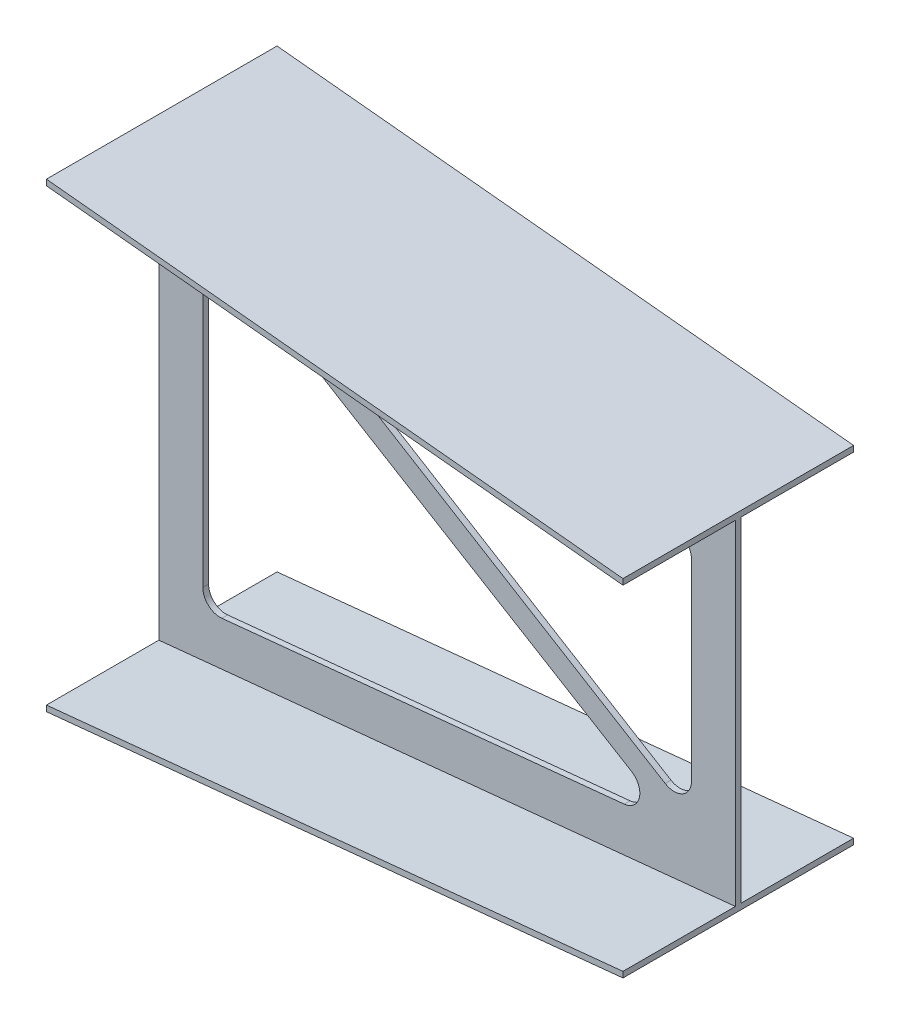
ISO-10303-21;
HEADER;
FILE_DESCRIPTION(('STEP AP214'),'2;1');
FILE_NAME('part.step','',(''),(''),'','','');
FILE_SCHEMA(('AUTOMOTIVE_DESIGN { 1 0 10303 214 1 1 1 1 }'));
ENDSEC;
DATA;
#1=APPLICATION_CONTEXT('core data for automotive mechanical design processes');
#2=APPLICATION_PROTOCOL_DEFINITION('international standard','automotive_design',2000,#1);
#3=PRODUCT_CONTEXT('',#1,'mechanical');
#4=PRODUCT('Part','Part','',(#3));
#5=PRODUCT_RELATED_PRODUCT_CATEGORY('part','',(#4));
#6=PRODUCT_DEFINITION_FORMATION('','',#4);
#7=PRODUCT_DEFINITION_CONTEXT('part definition',#1,'design');
#8=PRODUCT_DEFINITION('design','',#6,#7);
#9=PRODUCT_DEFINITION_SHAPE('','',#8);
#10=(LENGTH_UNIT() NAMED_UNIT(*) SI_UNIT(.MILLI.,.METRE.));
#11=(NAMED_UNIT(*) PLANE_ANGLE_UNIT() SI_UNIT($,.RADIAN.));
#12=(NAMED_UNIT(*) SI_UNIT($,.STERADIAN.) SOLID_ANGLE_UNIT());
#13=UNCERTAINTY_MEASURE_WITH_UNIT(LENGTH_MEASURE(1.E-05),#10,'distance_accuracy_value','');
#14=(GEOMETRIC_REPRESENTATION_CONTEXT(3) GLOBAL_UNCERTAINTY_ASSIGNED_CONTEXT((#13)) GLOBAL_UNIT_ASSIGNED_CONTEXT((#10,
#11,#12)) REPRESENTATION_CONTEXT('',''));
#15=CARTESIAN_POINT('',(0.,0.,0.));
#16=DIRECTION('',(0.,0.,1.));
#17=DIRECTION('',(1.,0.,0.));
#18=AXIS2_PLACEMENT_3D('',#15,#16,#17);
#19=CARTESIAN_POINT('',(1000.,0.,0.));
#20=DIRECTION('',(-1.,0.,0.));
#21=DIRECTION('',(0.,0.,1.));
#22=AXIS2_PLACEMENT_3D('',#19,#20,#21);
#23=PLANE('',#22);
#24=DIRECTION('',(0.,-1.,0.));
#25=VECTOR('',#24,1.);
#26=CARTESIAN_POINT('',(1000.,300.,-195.));
#27=LINE('',#26,#25);
#28=CARTESIAN_POINT('',(1000.,300.,-195.));
#29=VERTEX_POINT('',#28);
#30=CARTESIAN_POINT('',(1000.,290.,-195.));
#31=VERTEX_POINT('',#30);
#32=EDGE_CURVE('E589',#29,#31,#27,.T.);
#33=ORIENTED_EDGE('',*,*,#32,.F.);
#34=DIRECTION('',(0.,0.,-1.));
#35=VECTOR('',#34,1.);
#36=CARTESIAN_POINT('',(1000.,300.,-195.));
#37=LINE('',#36,#35);
#38=CARTESIAN_POINT('',(1000.,300.,205.));
#39=VERTEX_POINT('',#38);
#40=EDGE_CURVE('E718',#39,#29,#37,.T.);
#41=ORIENTED_EDGE('',*,*,#40,.F.);
#42=DIRECTION('',(0.,1.,0.));
#43=VECTOR('',#42,1.);
#44=CARTESIAN_POINT('',(1000.,300.,205.));
#45=LINE('',#44,#43);
#46=CARTESIAN_POINT('',(1000.,290.,205.));
#47=VERTEX_POINT('',#46);
#48=EDGE_CURVE('E338',#47,#39,#45,.T.);
#49=ORIENTED_EDGE('',*,*,#48,.F.);
#50=DIRECTION('',(0.,0.,1.));
#51=VECTOR('',#50,1.);
#52=CARTESIAN_POINT('',(1000.,290.,10.0000000000002));
#53=LINE('',#52,#51);
#54=CARTESIAN_POINT('',(1000.,290.,10.0000000000002));
#55=VERTEX_POINT('',#54);
#56=EDGE_CURVE('E352',#55,#47,#53,.T.);
#57=ORIENTED_EDGE('',*,*,#56,.F.);
#58=DIRECTION('',(0.,1.,0.));
#59=VECTOR('',#58,1.);
#60=CARTESIAN_POINT('',(1000.,290.,10.0000000000002));
#61=LINE('',#60,#59);
#62=CARTESIAN_POINT('',(1000.,-290.,10.0000000000002));
#63=VERTEX_POINT('',#62);
#64=EDGE_CURVE('E844',#63,#55,#61,.T.);
#65=ORIENTED_EDGE('',*,*,#64,.F.);
#66=DIRECTION('',(0.,0.,-1.));
#67=VECTOR('',#66,1.);
#68=CARTESIAN_POINT('',(1000.,-290.,10.0000000000002));
#69=LINE('',#68,#67);
#70=CARTESIAN_POINT('',(1000.,-290.,205.));
#71=VERTEX_POINT('',#70);
#72=EDGE_CURVE('E846',#71,#63,#69,.T.);
#73=ORIENTED_EDGE('',*,*,#72,.F.);
#74=DIRECTION('',(0.,1.,0.));
#75=VECTOR('',#74,1.);
#76=CARTESIAN_POINT('',(1000.,-290.,205.));
#77=LINE('',#76,#75);
#78=CARTESIAN_POINT('',(1000.,-300.,205.));
#79=VERTEX_POINT('',#78);
#80=EDGE_CURVE('E849',#79,#71,#77,.T.);
#81=ORIENTED_EDGE('',*,*,#80,.F.);
#82=DIRECTION('',(0.,0.,1.));
#83=VECTOR('',#82,1.);
#84=CARTESIAN_POINT('',(1000.,-300.,-195.));
#85=LINE('',#84,#83);
#86=CARTESIAN_POINT('',(1000.,-300.,-195.));
#87=VERTEX_POINT('',#86);
#88=EDGE_CURVE('E468',#87,#79,#85,.T.);
#89=ORIENTED_EDGE('',*,*,#88,.F.);
#90=DIRECTION('',(0.,-1.,0.));
#91=VECTOR('',#90,1.);
#92=CARTESIAN_POINT('',(1000.,-290.,-195.));
#93=LINE('',#92,#91);
#94=CARTESIAN_POINT('',(1000.,-290.,-195.));
#95=VERTEX_POINT('',#94);
#96=EDGE_CURVE('E482',#95,#87,#93,.T.);
#97=ORIENTED_EDGE('',*,*,#96,.F.);
#98=DIRECTION('',(0.,0.,-1.));
#99=VECTOR('',#98,1.);
#100=CARTESIAN_POINT('',(1000.,-290.,-195.));
#101=LINE('',#100,#99);
#102=CARTESIAN_POINT('',(1000.,-290.,4.44089209850063E-13));
#103=VERTEX_POINT('',#102);
#104=EDGE_CURVE('E964',#103,#95,#101,.T.);
#105=ORIENTED_EDGE('',*,*,#104,.F.);
#106=DIRECTION('',(0.,-1.,0.));
#107=VECTOR('',#106,1.);
#108=CARTESIAN_POINT('',(1000.,290.,4.44089209850063E-13));
#109=LINE('',#108,#107);
#110=CARTESIAN_POINT('',(1000.,290.,4.44089209850063E-13));
#111=VERTEX_POINT('',#110);
#112=EDGE_CURVE('E733',#111,#103,#109,.T.);
#113=ORIENTED_EDGE('',*,*,#112,.F.);
#114=DIRECTION('',(0.,0.,1.));
#115=VECTOR('',#114,1.);
#116=CARTESIAN_POINT('',(1000.,290.,-195.));
#117=LINE('',#116,#115);
#118=EDGE_CURVE('E575',#31,#111,#117,.T.);
#119=ORIENTED_EDGE('',*,*,#118,.F.);
#120=EDGE_LOOP('',(#33,#41,#49,#57,#65,#73,#81,#89,#97,#105,#113,#119));
#121=FACE_BOUND('',#120,.T.);
#122=ADVANCED_FACE('F61',(#121),#23,.F.);
#123=CARTESIAN_POINT('',(0.,0.,0.));
#124=DIRECTION('',(1.,0.,0.));
#125=DIRECTION('',(0.,0.,-1.));
#126=AXIS2_PLACEMENT_3D('',#123,#124,#125);
#127=PLANE('',#126);
#128=DIRECTION('',(0.,-1.,0.));
#129=VECTOR('',#128,1.);
#130=CARTESIAN_POINT('',(0.,400.,205.));
#131=LINE('',#130,#129);
#132=CARTESIAN_POINT('',(0.,400.,205.));
#133=VERTEX_POINT('',#132);
#134=CARTESIAN_POINT('',(0.,390.,205.));
#135=VERTEX_POINT('',#134);
#136=EDGE_CURVE('E284',#133,#135,#131,.T.);
#137=ORIENTED_EDGE('',*,*,#136,.F.);
#138=DIRECTION('',(0.,0.,1.));
#139=VECTOR('',#138,1.);
#140=CARTESIAN_POINT('',(0.,400.,205.));
#141=LINE('',#140,#139);
#142=CARTESIAN_POINT('',(0.,400.,-195.));
#143=VERTEX_POINT('',#142);
#144=EDGE_CURVE('E299',#143,#133,#141,.T.);
#145=ORIENTED_EDGE('',*,*,#144,.F.);
#146=DIRECTION('',(0.,1.,0.));
#147=VECTOR('',#146,1.);
#148=CARTESIAN_POINT('',(0.,400.,-195.));
#149=LINE('',#148,#147);
#150=CARTESIAN_POINT('',(0.,390.,-195.));
#151=VERTEX_POINT('',#150);
#152=EDGE_CURVE('E604',#151,#143,#149,.T.);
#153=ORIENTED_EDGE('',*,*,#152,.F.);
#154=DIRECTION('',(0.,0.,-1.));
#155=VECTOR('',#154,1.);
#156=CARTESIAN_POINT('',(0.,390.,-1.97758476261356E-13));
#157=LINE('',#156,#155);
#158=CARTESIAN_POINT('',(0.,390.,-1.97758476261356E-13));
#159=VERTEX_POINT('',#158);
#160=EDGE_CURVE('E711',#159,#151,#157,.T.);
#161=ORIENTED_EDGE('',*,*,#160,.F.);
#162=DIRECTION('',(0.,1.,0.));
#163=VECTOR('',#162,1.);
#164=CARTESIAN_POINT('',(0.,390.,-1.97758476261356E-13));
#165=LINE('',#164,#163);
#166=CARTESIAN_POINT('',(0.,-390.,-1.97758476261356E-13));
#167=VERTEX_POINT('',#166);
#168=EDGE_CURVE('E542',#167,#159,#165,.T.);
#169=ORIENTED_EDGE('',*,*,#168,.F.);
#170=DIRECTION('',(0.,0.,1.));
#171=VECTOR('',#170,1.);
#172=CARTESIAN_POINT('',(0.,-390.,-1.97758476261356E-13));
#173=LINE('',#172,#171);
#174=CARTESIAN_POINT('',(0.,-390.,-195.));
#175=VERTEX_POINT('',#174);
#176=EDGE_CURVE('E524',#175,#167,#173,.T.);
#177=ORIENTED_EDGE('',*,*,#176,.F.);
#178=DIRECTION('',(0.,1.,0.));
#179=VECTOR('',#178,1.);
#180=CARTESIAN_POINT('',(0.,-390.,-195.));
#181=LINE('',#180,#179);
#182=CARTESIAN_POINT('',(0.,-400.,-195.));
#183=VERTEX_POINT('',#182);
#184=EDGE_CURVE('E704',#183,#175,#181,.T.);
#185=ORIENTED_EDGE('',*,*,#184,.F.);
#186=DIRECTION('',(0.,0.,-1.));
#187=VECTOR('',#186,1.);
#188=CARTESIAN_POINT('',(0.,-400.,205.));
#189=LINE('',#188,#187);
#190=CARTESIAN_POINT('',(0.,-400.,205.));
#191=VERTEX_POINT('',#190);
#192=EDGE_CURVE('E700',#191,#183,#189,.T.);
#193=ORIENTED_EDGE('',*,*,#192,.F.);
#194=DIRECTION('',(0.,-1.,0.));
#195=VECTOR('',#194,1.);
#196=CARTESIAN_POINT('',(0.,-390.,205.));
#197=LINE('',#196,#195);
#198=CARTESIAN_POINT('',(0.,-390.,205.));
#199=VERTEX_POINT('',#198);
#200=EDGE_CURVE('E433',#199,#191,#197,.T.);
#201=ORIENTED_EDGE('',*,*,#200,.F.);
#202=DIRECTION('',(0.,0.,1.));
#203=VECTOR('',#202,1.);
#204=CARTESIAN_POINT('',(0.,-390.,205.));
#205=LINE('',#204,#203);
#206=CARTESIAN_POINT('',(0.,-390.,10.0000000000002));
#207=VERTEX_POINT('',#206);
#208=EDGE_CURVE('E415',#207,#199,#205,.T.);
#209=ORIENTED_EDGE('',*,*,#208,.F.);
#210=DIRECTION('',(0.,-1.,0.));
#211=VECTOR('',#210,1.);
#212=CARTESIAN_POINT('',(0.,390.,10.0000000000002));
#213=LINE('',#212,#211);
#214=CARTESIAN_POINT('',(0.,390.,10.0000000000002));
#215=VERTEX_POINT('',#214);
#216=EDGE_CURVE('E398',#215,#207,#213,.T.);
#217=ORIENTED_EDGE('',*,*,#216,.F.);
#218=DIRECTION('',(0.,0.,-1.));
#219=VECTOR('',#218,1.);
#220=CARTESIAN_POINT('',(0.,390.,205.));
#221=LINE('',#220,#219);
#222=EDGE_CURVE('E688',#135,#215,#221,.T.);
#223=ORIENTED_EDGE('',*,*,#222,.F.);
#224=EDGE_LOOP('',(#137,#145,#153,#161,#169,#177,#185,#193,#201,#209,#217,#223));
#225=FACE_BOUND('',#224,.T.);
#226=ADVANCED_FACE('F616',(#225),#127,.F.);
#227=CARTESIAN_POINT('',(0.,0.,10.0000000000002));
#228=DIRECTION('',(0.,0.,1.));
#229=DIRECTION('',(1.,0.,0.));
#230=AXIS2_PLACEMENT_3D('',#227,#228,#229);
#231=PLANE('',#230);
#232=CARTESIAN_POINT('',(804.27647772001,-202.842673131695,10.0000000000002));
#233=DIRECTION('',(0.,0.,1.));
#234=DIRECTION('',(1.,0.,0.));
#235=AXIS2_PLACEMENT_3D('',#232,#233,#234);
#236=CIRCLE('',#235,30.);
#237=CARTESIAN_POINT('',(807.261589290639,-232.693788837995,10.0000000000002));
#238=VERTEX_POINT('',#237);
#239=CARTESIAN_POINT('',(819.804188987503,-177.17381685033,10.0000000000002));
#240=VERTEX_POINT('',#239);
#241=EDGE_CURVE('E76',#238,#240,#236,.T.);
#242=ORIENTED_EDGE('',*,*,#241,.F.);
#243=DIRECTION('',(0.995037190209989,0.0995037190209989,0.));
#244=VECTOR('',#243,1.);
#245=CARTESIAN_POINT('',(109.18511157063,-302.501436609996,10.0000000000002));
#246=LINE('',#245,#244);
#247=CARTESIAN_POINT('',(109.18511157063,-302.501436609996,10.0000000000002));
#248=VERTEX_POINT('',#247);
#249=EDGE_CURVE('E254',#248,#238,#246,.T.);
#250=ORIENTED_EDGE('',*,*,#249,.F.);
#251=CARTESIAN_POINT('',(106.2,-272.650320903696,10.0000000000002));
#252=DIRECTION('',(0.,0.,1.));
#253=DIRECTION('',(-1.,0.,0.));
#254=AXIS2_PLACEMENT_3D('',#251,#252,#253);
#255=CIRCLE('',#254,30.);
#256=CARTESIAN_POINT('',(76.2,-272.650320903696,10.0000000000002));
#257=VERTEX_POINT('',#256);
#258=EDGE_CURVE('E248',#257,#248,#255,.T.);
#259=ORIENTED_EDGE('',*,*,#258,.F.);
#260=DIRECTION('',(0.,-1.,0.));
#261=VECTOR('',#260,1.);
#262=CARTESIAN_POINT('',(76.2,219.440652227635,10.0000000000002));
#263=LINE('',#262,#261);
#264=CARTESIAN_POINT('',(76.2,219.440652227635,10.0000000000002));
#265=VERTEX_POINT('',#264);
#266=EDGE_CURVE('E246',#265,#257,#263,.T.);
#267=ORIENTED_EDGE('',*,*,#266,.F.);
#268=CARTESIAN_POINT('',(106.2,219.440652227636,10.0000000000002));
#269=DIRECTION('',(0.,0.,1.));
#270=DIRECTION('',(-1.,0.,0.));
#271=AXIS2_PLACEMENT_3D('',#268,#269,#270);
#272=CIRCLE('',#271,30.);
#273=CARTESIAN_POINT('',(121.727711267494,245.109508509,10.0000000000002));
#274=VERTEX_POINT('',#273);
#275=EDGE_CURVE('E228',#274,#265,#272,.T.);
#276=ORIENTED_EDGE('',*,*,#275,.F.);
#277=DIRECTION('',(-0.855628542712151,0.517590375583126,0.));
#278=VECTOR('',#277,1.);
#279=CARTESIAN_POINT('',(121.727711267494,245.109508509,10.0000000000002));
#280=LINE('',#279,#278);
#281=EDGE_CURVE('E238',#240,#274,#280,.T.);
#282=ORIENTED_EDGE('',*,*,#281,.F.);
#283=EDGE_LOOP('',(#242,#250,#259,#267,#276,#282));
#284=FACE_BOUND('',#283,.T.);
#285=CARTESIAN_POINT('',(893.8,193.890320903696,10.0000000000002));
#286=DIRECTION('',(0.,0.,1.));
#287=DIRECTION('',(1.,0.,0.));
#288=AXIS2_PLACEMENT_3D('',#285,#286,#287);
#289=CIRCLE('',#288,30.);
#290=CARTESIAN_POINT('',(923.8,193.890320903696,10.0000000000002));
#291=VERTEX_POINT('',#290);
#292=CARTESIAN_POINT('',(896.78511157063,223.741436609996,10.0000000000002));
#293=VERTEX_POINT('',#292);
#294=EDGE_CURVE('E84',#291,#293,#289,.T.);
#295=ORIENTED_EDGE('',*,*,#294,.F.);
#296=DIRECTION('',(0.,1.,0.));
#297=VECTOR('',#296,1.);
#298=CARTESIAN_POINT('',(923.8,-140.478624315303,10.0000000000002));
#299=LINE('',#298,#297);
#300=CARTESIAN_POINT('',(923.8,-140.478624315303,10.0000000000002));
#301=VERTEX_POINT('',#300);
#302=EDGE_CURVE('E278',#301,#291,#299,.T.);
#303=ORIENTED_EDGE('',*,*,#302,.F.);
#304=CARTESIAN_POINT('',(893.8,-140.478624315303,10.0000000000002));
#305=DIRECTION('',(0.,0.,1.));
#306=DIRECTION('',(-1.,0.,0.));
#307=AXIS2_PLACEMENT_3D('',#304,#305,#306);
#308=CIRCLE('',#307,30.);
#309=CARTESIAN_POINT('',(878.189220239105,-166.097046500458,10.0000000000002));
#310=VERTEX_POINT('',#309);
#311=EDGE_CURVE('E275',#310,#301,#308,.T.);
#312=ORIENTED_EDGE('',*,*,#311,.F.);
#313=DIRECTION('',(0.85394740617183,-0.520359325363161,0.));
#314=VECTOR('',#313,1.);
#315=CARTESIAN_POINT('',(221.736940012824,233.917126741168,10.0000000000002));
#316=LINE('',#315,#314);
#317=CARTESIAN_POINT('',(221.736940012824,233.917126741168,10.0000000000002));
#318=VERTEX_POINT('',#317);
#319=EDGE_CURVE('E272',#318,#310,#316,.T.);
#320=ORIENTED_EDGE('',*,*,#319,.F.);
#321=CARTESIAN_POINT('',(237.347719773717,259.535548926324,10.0000000000002));
#322=DIRECTION('',(0.,0.,1.));
#323=DIRECTION('',(-1.,0.,0.));
#324=AXIS2_PLACEMENT_3D('',#321,#322,#323);
#325=CIRCLE('',#324,30.);
#326=CARTESIAN_POINT('',(240.332831344349,289.386664632624,10.0000000000002));
#327=VERTEX_POINT('',#326);
#328=EDGE_CURVE('E269',#327,#318,#325,.T.);
#329=ORIENTED_EDGE('',*,*,#328,.F.);
#330=DIRECTION('',(-0.995037190209989,0.099503719020999,0.));
#331=VECTOR('',#330,1.);
#332=CARTESIAN_POINT('',(896.78511157063,223.741436609996,10.0000000000002));
#333=LINE('',#332,#331);
#334=EDGE_CURVE('E266',#293,#327,#333,.T.);
#335=ORIENTED_EDGE('',*,*,#334,.F.);
#336=EDGE_LOOP('',(#295,#303,#312,#320,#329,#335));
#337=FACE_BOUND('',#336,.T.);
#338=DIRECTION('',(0.995037190209989,0.099503719020999,0.));
#339=VECTOR('',#338,1.);
#340=CARTESIAN_POINT('',(0.,-390.,10.0000000000002));
#341=LINE('',#340,#339);
#342=EDGE_CURVE('E390',#207,#63,#341,.T.);
#343=ORIENTED_EDGE('',*,*,#342,.T.);
#344=ORIENTED_EDGE('',*,*,#64,.T.);
#345=DIRECTION('',(0.995037190209989,-0.099503719020999,0.));
#346=VECTOR('',#345,1.);
#347=CARTESIAN_POINT('',(0.,390.,10.0000000000002));
#348=LINE('',#347,#346);
#349=EDGE_CURVE('E382',#215,#55,#348,.T.);
#350=ORIENTED_EDGE('',*,*,#349,.F.);
#351=ORIENTED_EDGE('',*,*,#216,.T.);
#352=EDGE_LOOP('',(#343,#344,#350,#351));
#353=FACE_BOUND('',#352,.T.);
#354=ADVANCED_FACE('F242',(#284,#337,#353),#231,.T.);
#355=CARTESIAN_POINT('',(38.6138613861387,386.138613861386,-1.09923071745065E-13));
#356=DIRECTION('',(-0.099503719020999,-0.995037190209989,0.));
#357=DIRECTION('',(0.995037190209989,-0.099503719020999,0.));
#358=AXIS2_PLACEMENT_3D('',#355,#356,#357);
#359=PLANE('',#358);
#360=ORIENTED_EDGE('',*,*,#349,.T.);
#361=ORIENTED_EDGE('',*,*,#56,.T.);
#362=DIRECTION('',(0.995037190209989,-0.099503719020999,0.));
#363=VECTOR('',#362,1.);
#364=CARTESIAN_POINT('',(0.,390.,205.));
#365=LINE('',#364,#363);
#366=EDGE_CURVE('E720',#135,#47,#365,.T.);
#367=ORIENTED_EDGE('',*,*,#366,.F.);
#368=ORIENTED_EDGE('',*,*,#222,.T.);
#369=EDGE_LOOP('',(#360,#361,#367,#368));
#370=FACE_BOUND('',#369,.T.);
#371=ADVANCED_FACE('F359',(#370),#359,.T.);
#372=CARTESIAN_POINT('',(38.6138613861387,-386.138613861386,-1.09923071745065E-13));
#373=DIRECTION('',(-0.099503719020999,0.995037190209989,0.));
#374=DIRECTION('',(-0.995037190209989,-0.099503719020999,0.));
#375=AXIS2_PLACEMENT_3D('',#372,#373,#374);
#376=PLANE('',#375);
#377=DIRECTION('',(0.995037190209989,0.099503719020999,0.));
#378=VECTOR('',#377,1.);
#379=CARTESIAN_POINT('',(0.,-390.,205.));
#380=LINE('',#379,#378);
#381=EDGE_CURVE('E389',#199,#71,#380,.T.);
#382=ORIENTED_EDGE('',*,*,#381,.T.);
#383=ORIENTED_EDGE('',*,*,#72,.T.);
#384=ORIENTED_EDGE('',*,*,#342,.F.);
#385=ORIENTED_EDGE('',*,*,#208,.T.);
#386=EDGE_LOOP('',(#382,#383,#384,#385));
#387=FACE_BOUND('',#386,.T.);
#388=ADVANCED_FACE('F369',(#387),#376,.T.);
#389=CARTESIAN_POINT('',(0.,0.,205.));
#390=DIRECTION('',(0.,0.,1.));
#391=DIRECTION('',(1.,0.,0.));
#392=AXIS2_PLACEMENT_3D('',#389,#390,#391);
#393=PLANE('',#392);
#394=DIRECTION('',(0.995037190209989,0.099503719020999,0.));
#395=VECTOR('',#394,1.);
#396=CARTESIAN_POINT('',(0.,-400.,205.));
#397=LINE('',#396,#395);
#398=EDGE_CURVE('E426',#191,#79,#397,.T.);
#399=ORIENTED_EDGE('',*,*,#398,.T.);
#400=ORIENTED_EDGE('',*,*,#80,.T.);
#401=ORIENTED_EDGE('',*,*,#381,.F.);
#402=ORIENTED_EDGE('',*,*,#200,.T.);
#403=EDGE_LOOP('',(#399,#400,#401,#402));
#404=FACE_BOUND('',#403,.T.);
#405=ADVANCED_FACE('F439',(#404),#393,.T.);
#406=CARTESIAN_POINT('',(39.6039603960396,-396.039603960396,0.));
#407=DIRECTION('',(0.0995037190209989,-0.995037190209989,0.));
#408=DIRECTION('',(0.995037190209989,0.0995037190209989,0.));
#409=AXIS2_PLACEMENT_3D('',#406,#407,#408);
#410=PLANE('',#409);
#411=DIRECTION('',(0.995037190209989,0.0995037190209989,0.));
#412=VECTOR('',#411,1.);
#413=CARTESIAN_POINT('',(0.,-400.,-195.));
#414=LINE('',#413,#412);
#415=EDGE_CURVE('E516',#183,#87,#414,.T.);
#416=ORIENTED_EDGE('',*,*,#415,.T.);
#417=ORIENTED_EDGE('',*,*,#88,.T.);
#418=ORIENTED_EDGE('',*,*,#398,.F.);
#419=ORIENTED_EDGE('',*,*,#192,.T.);
#420=EDGE_LOOP('',(#416,#417,#418,#419));
#421=FACE_BOUND('',#420,.T.);
#422=ADVANCED_FACE('F448',(#421),#410,.T.);
#423=CARTESIAN_POINT('',(0.,0.,-195.));
#424=DIRECTION('',(0.,0.,-1.));
#425=DIRECTION('',(-1.,0.,0.));
#426=AXIS2_PLACEMENT_3D('',#423,#424,#425);
#427=PLANE('',#426);
#428=DIRECTION('',(0.995037190209989,0.0995037190209989,0.));
#429=VECTOR('',#428,1.);
#430=CARTESIAN_POINT('',(0.,-390.,-195.));
#431=LINE('',#430,#429);
#432=EDGE_CURVE('E508',#175,#95,#431,.T.);
#433=ORIENTED_EDGE('',*,*,#432,.T.);
#434=ORIENTED_EDGE('',*,*,#96,.T.);
#435=ORIENTED_EDGE('',*,*,#415,.F.);
#436=ORIENTED_EDGE('',*,*,#184,.T.);
#437=EDGE_LOOP('',(#433,#434,#435,#436));
#438=FACE_BOUND('',#437,.T.);
#439=ADVANCED_FACE('F488',(#438),#427,.T.);
#440=CARTESIAN_POINT('',(38.6138613861387,-386.138613861386,1.09923071745065E-13));
#441=DIRECTION('',(-0.099503719020999,0.995037190209989,0.));
#442=DIRECTION('',(-0.995037190209989,-0.099503719020999,0.));
#443=AXIS2_PLACEMENT_3D('',#440,#441,#442);
#444=PLANE('',#443);
#445=DIRECTION('',(0.995037190209989,0.099503719020999,0.));
#446=VECTOR('',#445,1.);
#447=CARTESIAN_POINT('',(0.,-390.,-1.97758476261356E-13));
#448=LINE('',#447,#446);
#449=EDGE_CURVE('E515',#167,#103,#448,.T.);
#450=ORIENTED_EDGE('',*,*,#449,.T.);
#451=ORIENTED_EDGE('',*,*,#104,.T.);
#452=ORIENTED_EDGE('',*,*,#432,.F.);
#453=ORIENTED_EDGE('',*,*,#176,.T.);
#454=EDGE_LOOP('',(#450,#451,#452,#453));
#455=FACE_BOUND('',#454,.T.);
#456=ADVANCED_FACE('F497',(#455),#444,.T.);
#457=CARTESIAN_POINT('',(0.,0.,-1.97758476261356E-13));
#458=DIRECTION('',(0.,0.,-1.));
#459=DIRECTION('',(-1.,0.,0.));
#460=AXIS2_PLACEMENT_3D('',#457,#458,#459);
#461=PLANE('',#460);
#462=CARTESIAN_POINT('',(804.27647772001,-202.842673131695,3.33066907387547E-13));
#463=DIRECTION('',(0.,0.,-1.));
#464=DIRECTION('',(-1.,0.,0.));
#465=AXIS2_PLACEMENT_3D('',#462,#463,#464);
#466=CIRCLE('',#465,30.);
#467=CARTESIAN_POINT('',(819.804188987503,-177.17381685033,0.));
#468=VERTEX_POINT('',#467);
#469=CARTESIAN_POINT('',(807.261589290639,-232.693788837995,0.));
#470=VERTEX_POINT('',#469);
#471=EDGE_CURVE('E12',#468,#470,#466,.T.);
#472=ORIENTED_EDGE('',*,*,#471,.F.);
#473=DIRECTION('',(0.855628542712151,-0.517590375583126,0.));
#474=VECTOR('',#473,1.);
#475=CARTESIAN_POINT('',(141.161275823463,233.35367583708,-1.07154438005531E-13));
#476=LINE('',#475,#474);
#477=CARTESIAN_POINT('',(121.727711267494,245.109508509,-1.19627826448676E-13));
#478=VERTEX_POINT('',#477);
#479=EDGE_CURVE('E772',#478,#468,#476,.T.);
#480=ORIENTED_EDGE('',*,*,#479,.F.);
#481=CARTESIAN_POINT('',(106.2,219.440652227636,-1.38777878078145E-13));
#482=DIRECTION('',(0.,0.,-1.));
#483=DIRECTION('',(-1.,0.,0.));
#484=AXIS2_PLACEMENT_3D('',#481,#482,#483);
#485=CIRCLE('',#484,30.);
#486=CARTESIAN_POINT('',(76.2,219.440652227635,-2.22044604925031E-13));
#487=VERTEX_POINT('',#486);
#488=EDGE_CURVE('E231',#487,#478,#485,.T.);
#489=ORIENTED_EDGE('',*,*,#488,.F.);
#490=DIRECTION('',(0.,1.,0.));
#491=VECTOR('',#490,1.);
#492=CARTESIAN_POINT('',(76.2,0.,-1.48849682579666E-13));
#493=LINE('',#492,#491);
#494=CARTESIAN_POINT('',(76.2,-272.650320903696,-1.94289029309402E-13));
#495=VERTEX_POINT('',#494);
#496=EDGE_CURVE('E775',#495,#487,#493,.T.);
#497=ORIENTED_EDGE('',*,*,#496,.F.);
#498=CARTESIAN_POINT('',(106.2,-272.650320903696,-1.38777878078145E-13));
#499=DIRECTION('',(0.,0.,-1.));
#500=DIRECTION('',(-1.,0.,0.));
#501=AXIS2_PLACEMENT_3D('',#498,#499,#500);
#502=CIRCLE('',#501,30.);
#503=CARTESIAN_POINT('',(109.18511157063,-302.501436609996,-2.22044604925031E-13));
#504=VERTEX_POINT('',#503);
#505=EDGE_CURVE('E777',#504,#495,#502,.T.);
#506=ORIENTED_EDGE('',*,*,#505,.F.);
#507=DIRECTION('',(-0.995037190209989,-0.0995037190209989,0.));
#508=VECTOR('',#507,1.);
#509=CARTESIAN_POINT('',(31.0316779967385,-310.316779967385,-1.77840865542995E-13));
#510=LINE('',#509,#508);
#511=EDGE_CURVE('E69',#470,#504,#510,.T.);
#512=ORIENTED_EDGE('',*,*,#511,.F.);
#513=EDGE_LOOP('',(#472,#480,#489,#497,#506,#512));
#514=FACE_BOUND('',#513,.T.);
#515=CARTESIAN_POINT('',(893.8,193.890320903696,3.88578058618805E-13));
#516=DIRECTION('',(0.,0.,-1.));
#517=DIRECTION('',(-1.,0.,0.));
#518=AXIS2_PLACEMENT_3D('',#515,#516,#517);
#519=CIRCLE('',#518,30.);
#520=CARTESIAN_POINT('',(896.78511157063,223.741436609996,1.11022302462516E-13));
#521=VERTEX_POINT('',#520);
#522=CARTESIAN_POINT('',(923.8,193.890320903696,3.33066907387547E-13));
#523=VERTEX_POINT('',#522);
#524=EDGE_CURVE('E770',#521,#523,#519,.T.);
#525=ORIENTED_EDGE('',*,*,#524,.F.);
#526=DIRECTION('',(0.995037190209989,-0.099503719020999,0.));
#527=VECTOR('',#526,1.);
#528=CARTESIAN_POINT('',(31.0316779967385,310.316779967385,-1.77840865542995E-13));
#529=LINE('',#528,#527);
#530=CARTESIAN_POINT('',(240.332831344349,289.386664632624,0.));
#531=VERTEX_POINT('',#530);
#532=EDGE_CURVE('E754',#531,#521,#529,.T.);
#533=ORIENTED_EDGE('',*,*,#532,.F.);
#534=CARTESIAN_POINT('',(237.347719773717,259.535548926324,0.));
#535=DIRECTION('',(0.,0.,-1.));
#536=DIRECTION('',(-1.,0.,0.));
#537=AXIS2_PLACEMENT_3D('',#534,#535,#536);
#538=CIRCLE('',#537,30.);
#539=CARTESIAN_POINT('',(221.736940012824,233.917126741168,-1.38777878078145E-13));
#540=VERTEX_POINT('',#539);
#541=EDGE_CURVE('E761',#540,#531,#538,.T.);
#542=ORIENTED_EDGE('',*,*,#541,.F.);
#543=DIRECTION('',(-0.85394740617183,0.520359325363161,0.));
#544=VECTOR('',#543,1.);
#545=CARTESIAN_POINT('',(163.983856528245,269.109405964077,0.));
#546=LINE('',#545,#544);
#547=CARTESIAN_POINT('',(878.189220239105,-166.097046500458,1.11022302462516E-13));
#548=VERTEX_POINT('',#547);
#549=EDGE_CURVE('E764',#548,#540,#546,.T.);
#550=ORIENTED_EDGE('',*,*,#549,.F.);
#551=CARTESIAN_POINT('',(893.8,-140.478624315303,3.88578058618805E-13));
#552=DIRECTION('',(0.,0.,-1.));
#553=DIRECTION('',(-1.,0.,0.));
#554=AXIS2_PLACEMENT_3D('',#551,#552,#553);
#555=CIRCLE('',#554,30.);
#556=CARTESIAN_POINT('',(923.8,-140.478624315303,3.05311331771918E-13));
#557=VERTEX_POINT('',#556);
#558=EDGE_CURVE('E766',#557,#548,#555,.T.);
#559=ORIENTED_EDGE('',*,*,#558,.F.);
#560=DIRECTION('',(0.,-1.,0.));
#561=VECTOR('',#560,1.);
#562=CARTESIAN_POINT('',(923.8,0.,3.95180416168372E-13));
#563=LINE('',#562,#561);
#564=EDGE_CURVE('E768',#523,#557,#563,.T.);
#565=ORIENTED_EDGE('',*,*,#564,.F.);
#566=EDGE_LOOP('',(#525,#533,#542,#550,#559,#565));
#567=FACE_BOUND('',#566,.T.);
#568=DIRECTION('',(0.995037190209989,-0.099503719020999,0.));
#569=VECTOR('',#568,1.);
#570=CARTESIAN_POINT('',(0.,390.,-1.97758476261356E-13));
#571=LINE('',#570,#569);
#572=EDGE_CURVE('E535',#159,#111,#571,.T.);
#573=ORIENTED_EDGE('',*,*,#572,.T.);
#574=ORIENTED_EDGE('',*,*,#112,.T.);
#575=ORIENTED_EDGE('',*,*,#449,.F.);
#576=ORIENTED_EDGE('',*,*,#168,.T.);
#577=EDGE_LOOP('',(#573,#574,#575,#576));
#578=FACE_BOUND('',#577,.T.);
#579=ADVANCED_FACE('F548',(#514,#567,#578),#461,.T.);
#580=CARTESIAN_POINT('',(38.6138613861387,386.138613861386,1.09923071745065E-13));
#581=DIRECTION('',(-0.0995037190209991,-0.995037190209989,0.));
#582=DIRECTION('',(0.995037190209989,-0.0995037190209991,0.));
#583=AXIS2_PLACEMENT_3D('',#580,#581,#582);
#584=PLANE('',#583);
#585=DIRECTION('',(0.995037190209989,-0.0995037190209991,0.));
#586=VECTOR('',#585,1.);
#587=CARTESIAN_POINT('',(0.,390.,-195.));
#588=LINE('',#587,#586);
#589=EDGE_CURVE('E716',#151,#31,#588,.T.);
#590=ORIENTED_EDGE('',*,*,#589,.T.);
#591=ORIENTED_EDGE('',*,*,#118,.T.);
#592=ORIENTED_EDGE('',*,*,#572,.F.);
#593=ORIENTED_EDGE('',*,*,#160,.T.);
#594=EDGE_LOOP('',(#590,#591,#592,#593));
#595=FACE_BOUND('',#594,.T.);
#596=ADVANCED_FACE('F556',(#595),#584,.T.);
#597=CARTESIAN_POINT('',(0.,0.,-195.));
#598=DIRECTION('',(0.,0.,-1.));
#599=DIRECTION('',(-1.,0.,0.));
#600=AXIS2_PLACEMENT_3D('',#597,#598,#599);
#601=PLANE('',#600);
#602=DIRECTION('',(0.995037190209989,-0.0995037190209991,0.));
#603=VECTOR('',#602,1.);
#604=CARTESIAN_POINT('',(0.,400.,-195.));
#605=LINE('',#604,#603);
#606=EDGE_CURVE('E305',#143,#29,#605,.T.);
#607=ORIENTED_EDGE('',*,*,#606,.T.);
#608=ORIENTED_EDGE('',*,*,#32,.T.);
#609=ORIENTED_EDGE('',*,*,#589,.F.);
#610=ORIENTED_EDGE('',*,*,#152,.T.);
#611=EDGE_LOOP('',(#607,#608,#609,#610));
#612=FACE_BOUND('',#611,.T.);
#613=ADVANCED_FACE('F317',(#612),#601,.T.);
#614=CARTESIAN_POINT('',(39.6039603960397,396.039603960396,0.));
#615=DIRECTION('',(0.099503719020999,0.995037190209989,0.));
#616=DIRECTION('',(-0.995037190209989,0.099503719020999,0.));
#617=AXIS2_PLACEMENT_3D('',#614,#615,#616);
#618=PLANE('',#617);
#619=DIRECTION('',(0.995037190209989,-0.099503719020999,0.));
#620=VECTOR('',#619,1.);
#621=CARTESIAN_POINT('',(0.,400.,205.));
#622=LINE('',#621,#620);
#623=EDGE_CURVE('E719',#133,#39,#622,.T.);
#624=ORIENTED_EDGE('',*,*,#623,.T.);
#625=ORIENTED_EDGE('',*,*,#40,.T.);
#626=ORIENTED_EDGE('',*,*,#606,.F.);
#627=ORIENTED_EDGE('',*,*,#144,.T.);
#628=EDGE_LOOP('',(#624,#625,#626,#627));
#629=FACE_BOUND('',#628,.T.);
#630=ADVANCED_FACE('F307',(#629),#618,.T.);
#631=CARTESIAN_POINT('',(0.,0.,205.));
#632=DIRECTION('',(0.,0.,1.));
#633=DIRECTION('',(1.,0.,0.));
#634=AXIS2_PLACEMENT_3D('',#631,#632,#633);
#635=PLANE('',#634);
#636=ORIENTED_EDGE('',*,*,#366,.T.);
#637=ORIENTED_EDGE('',*,*,#48,.T.);
#638=ORIENTED_EDGE('',*,*,#623,.F.);
#639=ORIENTED_EDGE('',*,*,#136,.T.);
#640=EDGE_LOOP('',(#636,#637,#638,#639));
#641=FACE_BOUND('',#640,.T.);
#642=ADVANCED_FACE('F316',(#641),#635,.T.);
#643=CARTESIAN_POINT('',(893.8,193.890320903696,-195.0001));
#644=DIRECTION('',(0.,0.,1.));
#645=DIRECTION('',(1.,0.,0.));
#646=AXIS2_PLACEMENT_3D('',#643,#644,#645);
#647=CYLINDRICAL_SURFACE('',#646,30.);
#648=ORIENTED_EDGE('',*,*,#524,.T.);
#649=DIRECTION('',(0.,0.,1.));
#650=VECTOR('',#649,1.);
#651=CARTESIAN_POINT('',(923.8,193.890320903696,-195.0001));
#652=LINE('',#651,#650);
#653=EDGE_CURVE('E282',#523,#291,#652,.T.);
#654=ORIENTED_EDGE('',*,*,#653,.T.);
#655=ORIENTED_EDGE('',*,*,#294,.T.);
#656=DIRECTION('',(0.,0.,1.));
#657=VECTOR('',#656,1.);
#658=CARTESIAN_POINT('',(896.78511157063,223.741436609996,-195.0001));
#659=LINE('',#658,#657);
#660=EDGE_CURVE('E281',#521,#293,#659,.T.);
#661=ORIENTED_EDGE('',*,*,#660,.F.);
#662=EDGE_LOOP('',(#648,#654,#655,#661));
#663=FACE_BOUND('',#662,.T.);
#664=ADVANCED_FACE('F625',(#663),#647,.F.);
#665=CARTESIAN_POINT('',(923.8,-140.478624315303,-195.0001));
#666=DIRECTION('',(1.,0.,0.));
#667=DIRECTION('',(0.,0.,-1.));
#668=AXIS2_PLACEMENT_3D('',#665,#666,#667);
#669=PLANE('',#668);
#670=ORIENTED_EDGE('',*,*,#564,.T.);
#671=DIRECTION('',(0.,0.,1.));
#672=VECTOR('',#671,1.);
#673=CARTESIAN_POINT('',(923.8,-140.478624315303,-195.0001));
#674=LINE('',#673,#672);
#675=EDGE_CURVE('E285',#557,#301,#674,.T.);
#676=ORIENTED_EDGE('',*,*,#675,.T.);
#677=ORIENTED_EDGE('',*,*,#302,.T.);
#678=ORIENTED_EDGE('',*,*,#653,.F.);
#679=EDGE_LOOP('',(#670,#676,#677,#678));
#680=FACE_BOUND('',#679,.T.);
#681=ADVANCED_FACE('F809',(#680),#669,.F.);
#682=CARTESIAN_POINT('',(893.8,-140.478624315303,-195.0001));
#683=DIRECTION('',(0.,0.,1.));
#684=DIRECTION('',(1.,0.,0.));
#685=AXIS2_PLACEMENT_3D('',#682,#683,#684);
#686=CYLINDRICAL_SURFACE('',#685,30.);
#687=ORIENTED_EDGE('',*,*,#558,.T.);
#688=DIRECTION('',(0.,0.,1.));
#689=VECTOR('',#688,1.);
#690=CARTESIAN_POINT('',(878.189220239105,-166.097046500458,-195.0001));
#691=LINE('',#690,#689);
#692=EDGE_CURVE('E287',#548,#310,#691,.T.);
#693=ORIENTED_EDGE('',*,*,#692,.T.);
#694=ORIENTED_EDGE('',*,*,#311,.T.);
#695=ORIENTED_EDGE('',*,*,#675,.F.);
#696=EDGE_LOOP('',(#687,#693,#694,#695));
#697=FACE_BOUND('',#696,.T.);
#698=ADVANCED_FACE('F812',(#697),#686,.F.);
#699=CARTESIAN_POINT('',(221.736940012824,233.917126741168,-195.0001));
#700=DIRECTION('',(-0.520359325363161,-0.85394740617183,0.));
#701=DIRECTION('',(0.85394740617183,-0.520359325363161,0.));
#702=AXIS2_PLACEMENT_3D('',#699,#700,#701);
#703=PLANE('',#702);
#704=ORIENTED_EDGE('',*,*,#549,.T.);
#705=DIRECTION('',(0.,0.,1.));
#706=VECTOR('',#705,1.);
#707=CARTESIAN_POINT('',(221.736940012824,233.917126741168,-195.0001));
#708=LINE('',#707,#706);
#709=EDGE_CURVE('E289',#540,#318,#708,.T.);
#710=ORIENTED_EDGE('',*,*,#709,.T.);
#711=ORIENTED_EDGE('',*,*,#319,.T.);
#712=ORIENTED_EDGE('',*,*,#692,.F.);
#713=EDGE_LOOP('',(#704,#710,#711,#712));
#714=FACE_BOUND('',#713,.T.);
#715=ADVANCED_FACE('F816',(#714),#703,.F.);
#716=CARTESIAN_POINT('',(237.347719773717,259.535548926324,-195.0001));
#717=DIRECTION('',(0.,0.,1.));
#718=DIRECTION('',(1.,0.,0.));
#719=AXIS2_PLACEMENT_3D('',#716,#717,#718);
#720=CYLINDRICAL_SURFACE('',#719,30.);
#721=ORIENTED_EDGE('',*,*,#541,.T.);
#722=DIRECTION('',(0.,0.,1.));
#723=VECTOR('',#722,1.);
#724=CARTESIAN_POINT('',(240.332831344349,289.386664632624,-195.0001));
#725=LINE('',#724,#723);
#726=EDGE_CURVE('E291',#531,#327,#725,.T.);
#727=ORIENTED_EDGE('',*,*,#726,.T.);
#728=ORIENTED_EDGE('',*,*,#328,.T.);
#729=ORIENTED_EDGE('',*,*,#709,.F.);
#730=EDGE_LOOP('',(#721,#727,#728,#729));
#731=FACE_BOUND('',#730,.T.);
#732=ADVANCED_FACE('F820',(#731),#720,.F.);
#733=CARTESIAN_POINT('',(896.78511157063,223.741436609996,-195.0001));
#734=DIRECTION('',(0.099503719020999,0.995037190209989,0.));
#735=DIRECTION('',(-0.995037190209989,0.099503719020999,0.));
#736=AXIS2_PLACEMENT_3D('',#733,#734,#735);
#737=PLANE('',#736);
#738=ORIENTED_EDGE('',*,*,#532,.T.);
#739=ORIENTED_EDGE('',*,*,#660,.T.);
#740=ORIENTED_EDGE('',*,*,#334,.T.);
#741=ORIENTED_EDGE('',*,*,#726,.F.);
#742=EDGE_LOOP('',(#738,#739,#740,#741));
#743=FACE_BOUND('',#742,.T.);
#744=ADVANCED_FACE('F808',(#743),#737,.F.);
#745=CARTESIAN_POINT('',(804.27647772001,-202.842673131695,-195.0001));
#746=DIRECTION('',(0.,0.,1.));
#747=DIRECTION('',(1.,0.,0.));
#748=AXIS2_PLACEMENT_3D('',#745,#746,#747);
#749=CYLINDRICAL_SURFACE('',#748,30.);
#750=ORIENTED_EDGE('',*,*,#471,.T.);
#751=DIRECTION('',(0.,0.,1.));
#752=VECTOR('',#751,1.);
#753=CARTESIAN_POINT('',(807.261589290639,-232.693788837995,-195.0001));
#754=LINE('',#753,#752);
#755=EDGE_CURVE('E257',#470,#238,#754,.T.);
#756=ORIENTED_EDGE('',*,*,#755,.T.);
#757=ORIENTED_EDGE('',*,*,#241,.T.);
#758=DIRECTION('',(0.,0.,1.));
#759=VECTOR('',#758,1.);
#760=CARTESIAN_POINT('',(819.804188987503,-177.17381685033,-195.0001));
#761=LINE('',#760,#759);
#762=EDGE_CURVE('E235',#468,#240,#761,.T.);
#763=ORIENTED_EDGE('',*,*,#762,.F.);
#764=EDGE_LOOP('',(#750,#756,#757,#763));
#765=FACE_BOUND('',#764,.T.);
#766=ADVANCED_FACE('F805',(#765),#749,.F.);
#767=CARTESIAN_POINT('',(109.18511157063,-302.501436609996,-195.0001));
#768=DIRECTION('',(0.0995037190209989,-0.995037190209989,0.));
#769=DIRECTION('',(0.995037190209989,0.0995037190209989,0.));
#770=AXIS2_PLACEMENT_3D('',#767,#768,#769);
#771=PLANE('',#770);
#772=ORIENTED_EDGE('',*,*,#511,.T.);
#773=DIRECTION('',(0.,0.,1.));
#774=VECTOR('',#773,1.);
#775=CARTESIAN_POINT('',(109.18511157063,-302.501436609996,-195.0001));
#776=LINE('',#775,#774);
#777=EDGE_CURVE('E259',#504,#248,#776,.T.);
#778=ORIENTED_EDGE('',*,*,#777,.T.);
#779=ORIENTED_EDGE('',*,*,#249,.T.);
#780=ORIENTED_EDGE('',*,*,#755,.F.);
#781=EDGE_LOOP('',(#772,#778,#779,#780));
#782=FACE_BOUND('',#781,.T.);
#783=ADVANCED_FACE('F782',(#782),#771,.F.);
#784=CARTESIAN_POINT('',(106.2,-272.650320903696,-195.0001));
#785=DIRECTION('',(0.,0.,1.));
#786=DIRECTION('',(1.,0.,0.));
#787=AXIS2_PLACEMENT_3D('',#784,#785,#786);
#788=CYLINDRICAL_SURFACE('',#787,30.);
#789=ORIENTED_EDGE('',*,*,#505,.T.);
#790=DIRECTION('',(0.,0.,1.));
#791=VECTOR('',#790,1.);
#792=CARTESIAN_POINT('',(76.2,-272.650320903696,-195.0001));
#793=LINE('',#792,#791);
#794=EDGE_CURVE('E261',#495,#257,#793,.T.);
#795=ORIENTED_EDGE('',*,*,#794,.T.);
#796=ORIENTED_EDGE('',*,*,#258,.T.);
#797=ORIENTED_EDGE('',*,*,#777,.F.);
#798=EDGE_LOOP('',(#789,#795,#796,#797));
#799=FACE_BOUND('',#798,.T.);
#800=ADVANCED_FACE('F786',(#799),#788,.F.);
#801=CARTESIAN_POINT('',(76.2,219.440652227635,-195.0001));
#802=DIRECTION('',(-1.,0.,0.));
#803=DIRECTION('',(0.,0.,1.));
#804=AXIS2_PLACEMENT_3D('',#801,#802,#803);
#805=PLANE('',#804);
#806=ORIENTED_EDGE('',*,*,#496,.T.);
#807=DIRECTION('',(0.,0.,1.));
#808=VECTOR('',#807,1.);
#809=CARTESIAN_POINT('',(76.2,219.440652227635,-195.0001));
#810=LINE('',#809,#808);
#811=EDGE_CURVE('E234',#487,#265,#810,.T.);
#812=ORIENTED_EDGE('',*,*,#811,.T.);
#813=ORIENTED_EDGE('',*,*,#266,.T.);
#814=ORIENTED_EDGE('',*,*,#794,.F.);
#815=EDGE_LOOP('',(#806,#812,#813,#814));
#816=FACE_BOUND('',#815,.T.);
#817=ADVANCED_FACE('F792',(#816),#805,.F.);
#818=CARTESIAN_POINT('',(106.2,219.440652227636,-195.0001));
#819=DIRECTION('',(0.,0.,1.));
#820=DIRECTION('',(1.,0.,0.));
#821=AXIS2_PLACEMENT_3D('',#818,#819,#820);
#822=CYLINDRICAL_SURFACE('',#821,30.);
#823=ORIENTED_EDGE('',*,*,#488,.T.);
#824=DIRECTION('',(0.,0.,1.));
#825=VECTOR('',#824,1.);
#826=CARTESIAN_POINT('',(121.727711267494,245.109508509,-195.0001));
#827=LINE('',#826,#825);
#828=EDGE_CURVE('E223',#478,#274,#827,.T.);
#829=ORIENTED_EDGE('',*,*,#828,.T.);
#830=ORIENTED_EDGE('',*,*,#275,.T.);
#831=ORIENTED_EDGE('',*,*,#811,.F.);
#832=EDGE_LOOP('',(#823,#829,#830,#831));
#833=FACE_BOUND('',#832,.T.);
#834=ADVANCED_FACE('F225',(#833),#822,.F.);
#835=CARTESIAN_POINT('',(121.727711267494,245.109508509,-195.0001));
#836=DIRECTION('',(0.517590375583126,0.855628542712151,0.));
#837=DIRECTION('',(-0.855628542712151,0.517590375583126,0.));
#838=AXIS2_PLACEMENT_3D('',#835,#836,#837);
#839=PLANE('',#838);
#840=ORIENTED_EDGE('',*,*,#479,.T.);
#841=ORIENTED_EDGE('',*,*,#762,.T.);
#842=ORIENTED_EDGE('',*,*,#281,.T.);
#843=ORIENTED_EDGE('',*,*,#828,.F.);
#844=EDGE_LOOP('',(#840,#841,#842,#843));
#845=FACE_BOUND('',#844,.T.);
#846=ADVANCED_FACE('F239',(#845),#839,.F.);
#847=CLOSED_SHELL('',(#122,#226,#354,#371,#388,#405,#422,#439,#456,#579,#596,#613,#630,#642,
#664,#681,#698,#715,#732,#744,#766,#783,#800,#817,#834,#846));
#848=MANIFOLD_SOLID_BREP('B2',#847);
#849=ADVANCED_BREP_SHAPE_REPRESENTATION('',(#18,#848),#14);
#850=SHAPE_DEFINITION_REPRESENTATION(#9,#849);
ENDSEC;
END-ISO-10303-21;
